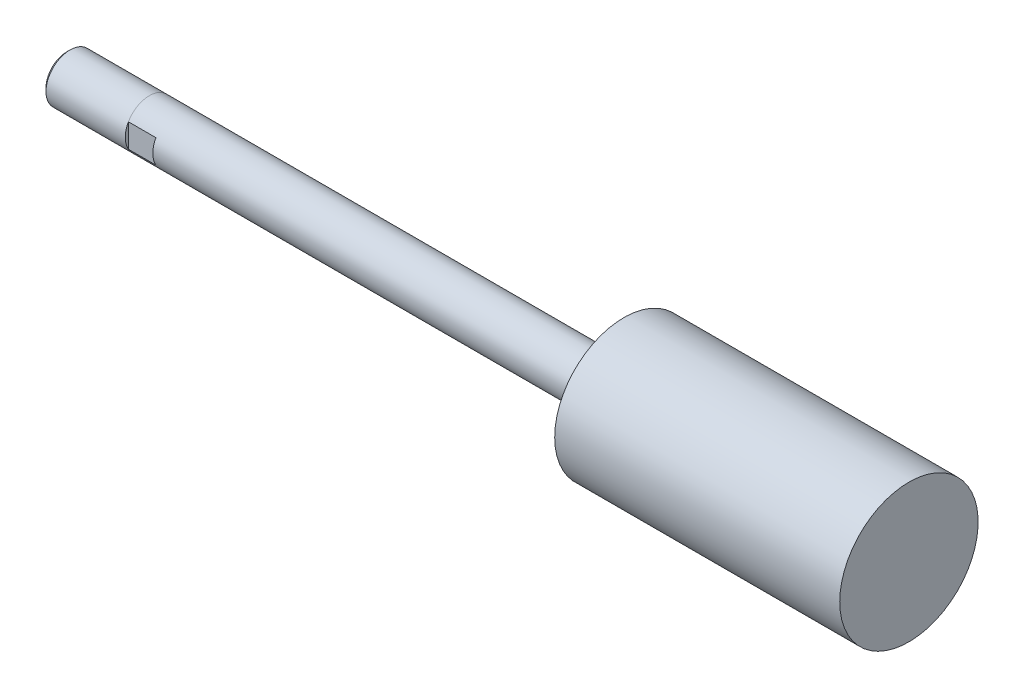
ISO-10303-21;
HEADER;
FILE_DESCRIPTION(('STEP AP214'),'2;1');
FILE_NAME('part.step','',(''),(''),'','','');
FILE_SCHEMA(('AUTOMOTIVE_DESIGN { 1 0 10303 214 1 1 1 1 }'));
ENDSEC;
DATA;
#1=APPLICATION_CONTEXT('core data for automotive mechanical design processes');
#2=APPLICATION_PROTOCOL_DEFINITION('international standard','automotive_design',2000,#1);
#3=PRODUCT_CONTEXT('',#1,'mechanical');
#4=PRODUCT('Part','Part','',(#3));
#5=PRODUCT_RELATED_PRODUCT_CATEGORY('part','',(#4));
#6=PRODUCT_DEFINITION_FORMATION('','',#4);
#7=PRODUCT_DEFINITION_CONTEXT('part definition',#1,'design');
#8=PRODUCT_DEFINITION('design','',#6,#7);
#9=PRODUCT_DEFINITION_SHAPE('','',#8);
#10=(LENGTH_UNIT() NAMED_UNIT(*) SI_UNIT(.MILLI.,.METRE.));
#11=(NAMED_UNIT(*) PLANE_ANGLE_UNIT() SI_UNIT($,.RADIAN.));
#12=(NAMED_UNIT(*) SI_UNIT($,.STERADIAN.) SOLID_ANGLE_UNIT());
#13=UNCERTAINTY_MEASURE_WITH_UNIT(LENGTH_MEASURE(1.E-05),#10,'distance_accuracy_value','');
#14=(GEOMETRIC_REPRESENTATION_CONTEXT(3) GLOBAL_UNCERTAINTY_ASSIGNED_CONTEXT((#13)) GLOBAL_UNIT_ASSIGNED_CONTEXT((#10,
#11,#12)) REPRESENTATION_CONTEXT('',''));
#15=CARTESIAN_POINT('',(0.,0.,0.));
#16=DIRECTION('',(0.,0.,1.));
#17=DIRECTION('',(1.,0.,0.));
#18=AXIS2_PLACEMENT_3D('',#15,#16,#17);
#19=CARTESIAN_POINT('',(168.9608,0.,0.));
#20=DIRECTION('',(-1.,0.,0.));
#21=DIRECTION('',(0.,0.,1.));
#22=AXIS2_PLACEMENT_3D('',#19,#20,#21);
#23=CYLINDRICAL_SURFACE('',#22,5.5499);
#24=DIRECTION('',(-1.,0.,0.));
#25=VECTOR('',#24,1.);
#26=CARTESIAN_POINT('',(168.9608,2.74064116768321,-4.826));
#27=LINE('',#26,#25);
#28=CARTESIAN_POINT('',(0.,2.74064116768321,-4.826));
#29=VERTEX_POINT('',#28);
#30=CARTESIAN_POINT('',(-6.35,2.74705930837324,-4.826));
#31=VERTEX_POINT('',#30);
#32=EDGE_CURVE('E101',#29,#31,#27,.T.);
#33=ORIENTED_EDGE('',*,*,#32,.T.);
#34=CARTESIAN_POINT('',(-6.35,0.,0.));
#35=DIRECTION('',(-1.,0.,0.));
#36=DIRECTION('',(0.,0.49469130573276,0.869068761394872));
#37=AXIS2_PLACEMENT_3D('',#34,#35,#36);
#38=CIRCLE('',#37,5.55625);
#39=CARTESIAN_POINT('',(-6.35,2.74705792258195,4.82600401218283));
#40=VERTEX_POINT('',#39);
#41=EDGE_CURVE('E81',#40,#31,#38,.T.);
#42=ORIENTED_EDGE('',*,*,#41,.F.);
#43=DIRECTION('',(-1.,0.,0.));
#44=VECTOR('',#43,1.);
#45=CARTESIAN_POINT('',(168.9608,2.74064116768321,4.826));
#46=LINE('',#45,#44);
#47=CARTESIAN_POINT('',(0.,2.74064116768321,4.826));
#48=VERTEX_POINT('',#47);
#49=EDGE_CURVE('E110',#40,#48,#46,.F.);
#50=ORIENTED_EDGE('',*,*,#49,.T.);
#51=CARTESIAN_POINT('',(0.,0.,0.));
#52=DIRECTION('',(1.,0.,0.));
#53=DIRECTION('',(0.,0.,-1.));
#54=AXIS2_PLACEMENT_3D('',#51,#52,#53);
#55=CIRCLE('',#54,5.5499);
#56=CARTESIAN_POINT('',(0.,-2.74064116768321,4.826));
#57=VERTEX_POINT('',#56);
#58=EDGE_CURVE('E11',#48,#57,#55,.T.);
#59=ORIENTED_EDGE('',*,*,#58,.T.);
#60=DIRECTION('',(-1.,0.,0.));
#61=VECTOR('',#60,1.);
#62=CARTESIAN_POINT('',(168.9608,-2.74064116768321,4.826));
#63=LINE('',#62,#61);
#64=CARTESIAN_POINT('',(-6.35,-2.74705930837324,4.826));
#65=VERTEX_POINT('',#64);
#66=EDGE_CURVE('E112',#57,#65,#63,.T.);
#67=ORIENTED_EDGE('',*,*,#66,.T.);
#68=CARTESIAN_POINT('',(-6.35,0.,0.));
#69=DIRECTION('',(-1.,0.,0.));
#70=DIRECTION('',(0.,-0.494691305732761,-0.869068761394871));
#71=AXIS2_PLACEMENT_3D('',#68,#69,#70);
#72=CIRCLE('',#71,5.55625);
#73=CARTESIAN_POINT('',(-6.35,-2.74705792258195,-4.82600401218282));
#74=VERTEX_POINT('',#73);
#75=EDGE_CURVE('E95',#74,#65,#72,.T.);
#76=ORIENTED_EDGE('',*,*,#75,.F.);
#77=DIRECTION('',(-1.,0.,0.));
#78=VECTOR('',#77,1.);
#79=CARTESIAN_POINT('',(168.9608,-2.74064116768321,-4.826));
#80=LINE('',#79,#78);
#81=CARTESIAN_POINT('',(0.,-2.74064116768321,-4.826));
#82=VERTEX_POINT('',#81);
#83=EDGE_CURVE('E104',#74,#82,#80,.F.);
#84=ORIENTED_EDGE('',*,*,#83,.T.);
#85=EDGE_CURVE('E41',#82,#29,#55,.T.);
#86=ORIENTED_EDGE('',*,*,#85,.T.);
#87=EDGE_LOOP('',(#33,#42,#50,#59,#67,#76,#84,#86));
#88=FACE_BOUND('',#87,.T.);
#89=CARTESIAN_POINT('',(103.1748,0.,0.));
#90=DIRECTION('',(-1.,0.,0.));
#91=DIRECTION('',(0.,0.,1.));
#92=AXIS2_PLACEMENT_3D('',#89,#90,#91);
#93=CIRCLE('',#92,5.5499);
#94=CARTESIAN_POINT('',(103.1748,0.,5.5499));
#95=VERTEX_POINT('',#94);
#96=EDGE_CURVE('E200',#95,#95,#93,.T.);
#97=ORIENTED_EDGE('',*,*,#96,.T.);
#98=EDGE_LOOP('',(#97));
#99=FACE_BOUND('',#98,.T.);
#100=ADVANCED_FACE('F37',(#88,#99),#23,.T.);
#101=CARTESIAN_POINT('',(103.1748,5.5499,0.));
#102=DIRECTION('',(1.,0.,0.));
#103=DIRECTION('',(0.,0.,-1.));
#104=AXIS2_PLACEMENT_3D('',#101,#102,#103);
#105=PLANE('',#104);
#106=ORIENTED_EDGE('',*,*,#96,.F.);
#107=EDGE_LOOP('',(#106));
#108=FACE_BOUND('',#107,.T.);
#109=CARTESIAN_POINT('',(103.1748,0.,0.));
#110=DIRECTION('',(-1.,0.,0.));
#111=DIRECTION('',(0.,0.,1.));
#112=AXIS2_PLACEMENT_3D('',#109,#110,#111);
#113=CIRCLE('',#112,15.97025);
#114=CARTESIAN_POINT('',(103.1748,0.,15.97025));
#115=VERTEX_POINT('',#114);
#116=EDGE_CURVE('E202',#115,#115,#113,.T.);
#117=ORIENTED_EDGE('',*,*,#116,.T.);
#118=EDGE_LOOP('',(#117));
#119=FACE_BOUND('',#118,.T.);
#120=ADVANCED_FACE('F220',(#108,#119),#105,.F.);
#121=CARTESIAN_POINT('',(168.9608,0.,0.));
#122=DIRECTION('',(-1.,0.,0.));
#123=DIRECTION('',(0.,0.,1.));
#124=AXIS2_PLACEMENT_3D('',#121,#122,#123);
#125=CYLINDRICAL_SURFACE('',#124,15.97025);
#126=ORIENTED_EDGE('',*,*,#116,.F.);
#127=EDGE_LOOP('',(#126));
#128=FACE_BOUND('',#127,.T.);
#129=CARTESIAN_POINT('',(168.9608,0.,0.));
#130=DIRECTION('',(-1.,0.,0.));
#131=DIRECTION('',(0.,0.,1.));
#132=AXIS2_PLACEMENT_3D('',#129,#130,#131);
#133=CIRCLE('',#132,15.97025);
#134=CARTESIAN_POINT('',(168.9608,0.,15.97025));
#135=VERTEX_POINT('',#134);
#136=EDGE_CURVE('E145',#135,#135,#133,.T.);
#137=ORIENTED_EDGE('',*,*,#136,.T.);
#138=EDGE_LOOP('',(#137));
#139=FACE_BOUND('',#138,.T.);
#140=ADVANCED_FACE('F209',(#128,#139),#125,.T.);
#141=CARTESIAN_POINT('',(168.9608,15.97025,0.));
#142=DIRECTION('',(-1.,0.,0.));
#143=DIRECTION('',(0.,0.,1.));
#144=AXIS2_PLACEMENT_3D('',#141,#142,#143);
#145=PLANE('',#144);
#146=ORIENTED_EDGE('',*,*,#136,.F.);
#147=EDGE_LOOP('',(#146));
#148=FACE_BOUND('',#147,.T.);
#149=ADVANCED_FACE('F211',(#148),#145,.F.);
#150=CARTESIAN_POINT('',(-25.4,0.,0.));
#151=DIRECTION('',(1.,0.,0.));
#152=DIRECTION('',(0.,0.,-1.));
#153=AXIS2_PLACEMENT_3D('',#150,#151,#152);
#154=PLANE('',#153);
#155=CARTESIAN_POINT('',(-25.4,0.,0.));
#156=DIRECTION('',(-1.,0.,0.));
#157=DIRECTION('',(0.,0.,1.));
#158=AXIS2_PLACEMENT_3D('',#155,#156,#157);
#159=CIRCLE('',#158,4.8006);
#160=CARTESIAN_POINT('',(-25.4,0.,4.8006));
#161=VERTEX_POINT('',#160);
#162=EDGE_CURVE('E138',#161,#161,#159,.T.);
#163=ORIENTED_EDGE('',*,*,#162,.T.);
#164=EDGE_LOOP('',(#163));
#165=FACE_BOUND('',#164,.T.);
#166=ADVANCED_FACE('F213',(#165),#154,.F.);
#167=CARTESIAN_POINT('',(-24.64435,0.,0.));
#168=DIRECTION('',(1.,0.,0.));
#169=DIRECTION('',(0.,0.,-1.));
#170=AXIS2_PLACEMENT_3D('',#167,#168,#169);
#171=CONICAL_SURFACE('',#170,5.55625,0.785398163397451);
#172=ORIENTED_EDGE('',*,*,#162,.F.);
#173=EDGE_LOOP('',(#172));
#174=FACE_BOUND('',#173,.T.);
#175=CARTESIAN_POINT('',(-24.64435,0.,0.));
#176=DIRECTION('',(-1.,0.,0.));
#177=DIRECTION('',(0.,0.,1.));
#178=AXIS2_PLACEMENT_3D('',#175,#176,#177);
#179=CIRCLE('',#178,5.55625);
#180=CARTESIAN_POINT('',(-24.64435,0.,5.55625));
#181=VERTEX_POINT('',#180);
#182=EDGE_CURVE('E135',#181,#181,#179,.T.);
#183=ORIENTED_EDGE('',*,*,#182,.T.);
#184=EDGE_LOOP('',(#183));
#185=FACE_BOUND('',#184,.T.);
#186=ADVANCED_FACE('F173',(#174,#185),#171,.T.);
#187=CARTESIAN_POINT('',(-6.35,0.,0.));
#188=DIRECTION('',(-1.,0.,0.));
#189=DIRECTION('',(0.,0.,1.));
#190=AXIS2_PLACEMENT_3D('',#187,#188,#189);
#191=CYLINDRICAL_SURFACE('',#190,5.55625);
#192=ORIENTED_EDGE('',*,*,#182,.F.);
#193=EDGE_LOOP('',(#192));
#194=FACE_BOUND('',#193,.T.);
#195=ORIENTED_EDGE('',*,*,#41,.T.);
#196=CARTESIAN_POINT('',(-6.35,0.,0.));
#197=DIRECTION('',(-1.,0.,0.));
#198=DIRECTION('',(0.,0.494691305732778,-0.869068761394862));
#199=AXIS2_PLACEMENT_3D('',#196,#197,#198);
#200=CIRCLE('',#199,5.55625);
#201=EDGE_CURVE('E84',#31,#74,#200,.T.);
#202=ORIENTED_EDGE('',*,*,#201,.T.);
#203=ORIENTED_EDGE('',*,*,#75,.T.);
#204=CARTESIAN_POINT('',(-6.35,0.,0.));
#205=DIRECTION('',(-1.,0.,0.));
#206=DIRECTION('',(0.,-0.494691305732759,0.869068761394873));
#207=AXIS2_PLACEMENT_3D('',#204,#205,#206);
#208=CIRCLE('',#207,5.55625);
#209=EDGE_CURVE('E86',#65,#40,#208,.T.);
#210=ORIENTED_EDGE('',*,*,#209,.T.);
#211=EDGE_LOOP('',(#195,#202,#203,#210));
#212=FACE_BOUND('',#211,.T.);
#213=ADVANCED_FACE('F83',(#194,#212),#191,.T.);
#214=CARTESIAN_POINT('',(-6.35,0.,0.));
#215=DIRECTION('',(1.,0.,0.));
#216=DIRECTION('',(0.,0.,-1.));
#217=AXIS2_PLACEMENT_3D('',#214,#215,#216);
#218=PLANE('',#217);
#219=ORIENTED_EDGE('',*,*,#201,.F.);
#220=DIRECTION('',(0.,1.,0.));
#221=VECTOR('',#220,1.);
#222=CARTESIAN_POINT('',(-6.35,-5.5499,-4.826));
#223=LINE('',#222,#221);
#224=EDGE_CURVE('E51',#74,#31,#223,.T.);
#225=ORIENTED_EDGE('',*,*,#224,.F.);
#226=EDGE_LOOP('',(#219,#225));
#227=FACE_BOUND('',#226,.T.);
#228=ADVANCED_FACE('F94',(#227),#218,.T.);
#229=CARTESIAN_POINT('',(0.,-5.5499,-4.826));
#230=DIRECTION('',(0.,0.,1.));
#231=DIRECTION('',(1.,0.,0.));
#232=AXIS2_PLACEMENT_3D('',#229,#230,#231);
#233=PLANE('',#232);
#234=DIRECTION('',(0.,1.,0.));
#235=VECTOR('',#234,1.);
#236=CARTESIAN_POINT('',(0.,-5.5499,-4.826));
#237=LINE('',#236,#235);
#238=EDGE_CURVE('E114',#82,#29,#237,.T.);
#239=ORIENTED_EDGE('',*,*,#238,.F.);
#240=ORIENTED_EDGE('',*,*,#83,.F.);
#241=ORIENTED_EDGE('',*,*,#224,.T.);
#242=ORIENTED_EDGE('',*,*,#32,.F.);
#243=EDGE_LOOP('',(#239,#240,#241,#242));
#244=FACE_BOUND('',#243,.T.);
#245=ADVANCED_FACE('F100',(#244),#233,.F.);
#246=CARTESIAN_POINT('',(0.,0.,0.));
#247=DIRECTION('',(1.,0.,0.));
#248=DIRECTION('',(0.,0.,-1.));
#249=AXIS2_PLACEMENT_3D('',#246,#247,#248);
#250=PLANE('',#249);
#251=ORIENTED_EDGE('',*,*,#238,.T.);
#252=ORIENTED_EDGE('',*,*,#85,.F.);
#253=EDGE_LOOP('',(#251,#252));
#254=FACE_BOUND('',#253,.T.);
#255=ADVANCED_FACE('F261',(#254),#250,.F.);
#256=DIRECTION('',(0.,-1.,0.));
#257=VECTOR('',#256,1.);
#258=CARTESIAN_POINT('',(0.,5.5499,4.826));
#259=LINE('',#258,#257);
#260=EDGE_CURVE('E106',#48,#57,#259,.T.);
#261=ORIENTED_EDGE('',*,*,#260,.T.);
#262=ORIENTED_EDGE('',*,*,#58,.F.);
#263=EDGE_LOOP('',(#261,#262));
#264=FACE_BOUND('',#263,.T.);
#265=ADVANCED_FACE('F131',(#264),#250,.F.);
#266=ORIENTED_EDGE('',*,*,#209,.F.);
#267=DIRECTION('',(0.,-1.,0.));
#268=VECTOR('',#267,1.);
#269=CARTESIAN_POINT('',(-6.35,5.5499,4.826));
#270=LINE('',#269,#268);
#271=EDGE_CURVE('E58',#40,#65,#270,.T.);
#272=ORIENTED_EDGE('',*,*,#271,.F.);
#273=EDGE_LOOP('',(#266,#272));
#274=FACE_BOUND('',#273,.T.);
#275=ADVANCED_FACE('F151',(#274),#218,.T.);
#276=CARTESIAN_POINT('',(0.,5.5499,4.826));
#277=DIRECTION('',(0.,0.,-1.));
#278=DIRECTION('',(-1.,0.,0.));
#279=AXIS2_PLACEMENT_3D('',#276,#277,#278);
#280=PLANE('',#279);
#281=ORIENTED_EDGE('',*,*,#260,.F.);
#282=ORIENTED_EDGE('',*,*,#49,.F.);
#283=ORIENTED_EDGE('',*,*,#271,.T.);
#284=ORIENTED_EDGE('',*,*,#66,.F.);
#285=EDGE_LOOP('',(#281,#282,#283,#284));
#286=FACE_BOUND('',#285,.T.);
#287=ADVANCED_FACE('F134',(#286),#280,.F.);
#288=CLOSED_SHELL('',(#100,#120,#140,#149,#166,#186,#213,#228,#245,#255,#265,#275,#287));
#289=MANIFOLD_SOLID_BREP('B2',#288);
#290=ADVANCED_BREP_SHAPE_REPRESENTATION('',(#18,#289),#14);
#291=SHAPE_DEFINITION_REPRESENTATION(#9,#290);
ENDSEC;
END-ISO-10303-21;
